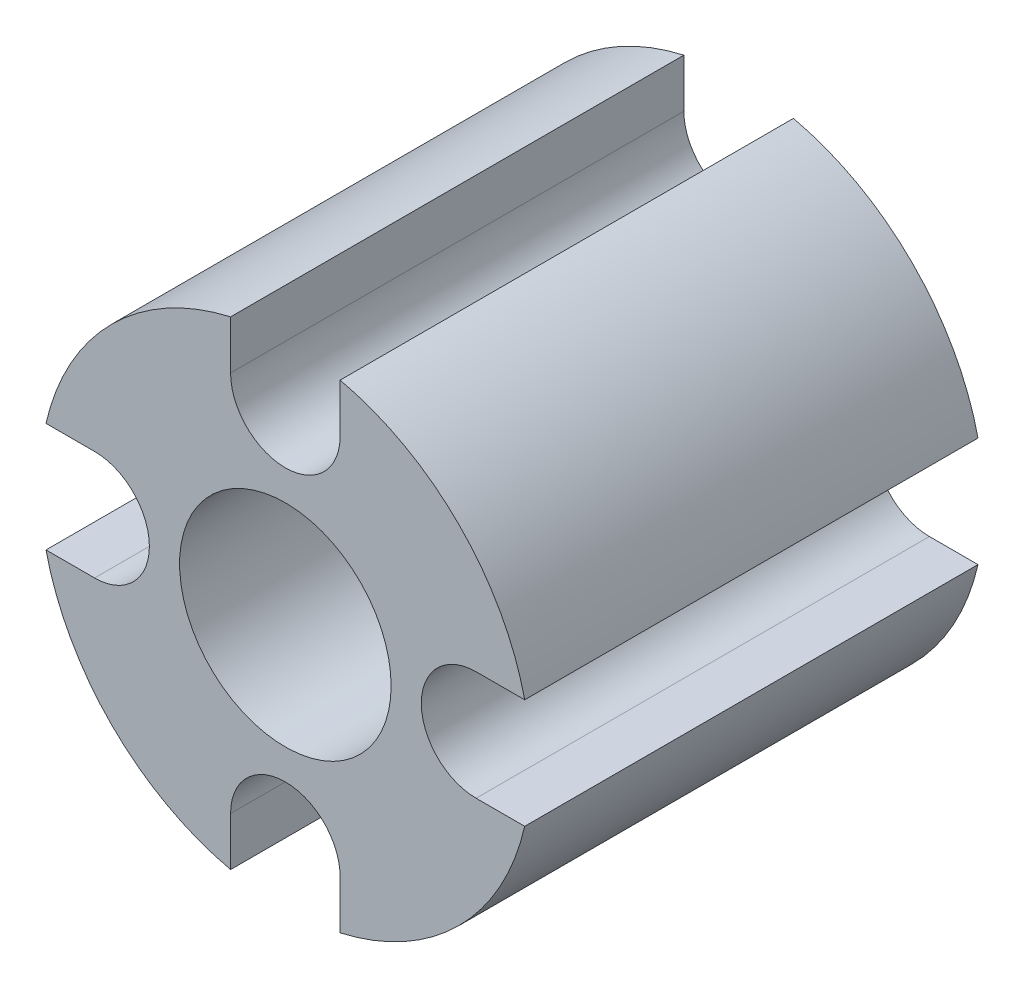
ISO-10303-21;
HEADER;
FILE_DESCRIPTION(('STEP AP214'),'2;1');
FILE_NAME('part.step','',(''),(''),'','','');
FILE_SCHEMA(('AUTOMOTIVE_DESIGN { 1 0 10303 214 1 1 1 1 }'));
ENDSEC;
DATA;
#1=APPLICATION_CONTEXT('core data for automotive mechanical design processes');
#2=APPLICATION_PROTOCOL_DEFINITION('international standard','automotive_design',2000,#1);
#3=PRODUCT_CONTEXT('',#1,'mechanical');
#4=PRODUCT('Part','Part','',(#3));
#5=PRODUCT_RELATED_PRODUCT_CATEGORY('part','',(#4));
#6=PRODUCT_DEFINITION_FORMATION('','',#4);
#7=PRODUCT_DEFINITION_CONTEXT('part definition',#1,'design');
#8=PRODUCT_DEFINITION('design','',#6,#7);
#9=PRODUCT_DEFINITION_SHAPE('','',#8);
#10=(LENGTH_UNIT() NAMED_UNIT(*) SI_UNIT(.MILLI.,.METRE.));
#11=(NAMED_UNIT(*) PLANE_ANGLE_UNIT() SI_UNIT($,.RADIAN.));
#12=(NAMED_UNIT(*) SI_UNIT($,.STERADIAN.) SOLID_ANGLE_UNIT());
#13=UNCERTAINTY_MEASURE_WITH_UNIT(LENGTH_MEASURE(1.E-05),#10,'distance_accuracy_value','');
#14=(GEOMETRIC_REPRESENTATION_CONTEXT(3) GLOBAL_UNCERTAINTY_ASSIGNED_CONTEXT((#13)) GLOBAL_UNIT_ASSIGNED_CONTEXT((#10,
#11,#12)) REPRESENTATION_CONTEXT('',''));
#15=CARTESIAN_POINT('',(0.,0.,0.));
#16=DIRECTION('',(0.,0.,1.));
#17=DIRECTION('',(1.,0.,0.));
#18=AXIS2_PLACEMENT_3D('',#15,#16,#17);
#19=CARTESIAN_POINT('',(0.,2.525,6.));
#20=DIRECTION('',(0.,0.,1.));
#21=DIRECTION('',(1.,0.,0.));
#22=AXIS2_PLACEMENT_3D('',#19,#20,#21);
#23=PLANE('',#22);
#24=CARTESIAN_POINT('',(0.,2.525,6.));
#25=DIRECTION('',(0.,0.,-1.));
#26=DIRECTION('',(1.,0.,0.));
#27=AXIS2_PLACEMENT_3D('',#24,#25,#26);
#28=CIRCLE('',#27,0.725);
#29=CARTESIAN_POINT('',(0.725,2.525,6.));
#30=VERTEX_POINT('',#29);
#31=CARTESIAN_POINT('',(-0.725,2.525,6.));
#32=VERTEX_POINT('',#31);
#33=EDGE_CURVE('E209',#30,#32,#28,.T.);
#34=ORIENTED_EDGE('',*,*,#33,.T.);
#35=DIRECTION('',(0.,1.,0.));
#36=VECTOR('',#35,1.);
#37=CARTESIAN_POINT('',(-0.725,2.525,6.));
#38=LINE('',#37,#36);
#39=CARTESIAN_POINT('',(-0.724999999999996,3.16810274454598,6.));
#40=VERTEX_POINT('',#39);
#41=EDGE_CURVE('E117',#32,#40,#38,.T.);
#42=ORIENTED_EDGE('',*,*,#41,.T.);
#43=CARTESIAN_POINT('',(0.,0.,6.));
#44=DIRECTION('',(0.,0.,1.));
#45=DIRECTION('',(1.,0.,0.));
#46=AXIS2_PLACEMENT_3D('',#43,#44,#45);
#47=CIRCLE('',#46,3.24999999999997);
#48=CARTESIAN_POINT('',(-3.16810274454595,0.724999999999984,6.));
#49=VERTEX_POINT('',#48);
#50=EDGE_CURVE('E248',#40,#49,#47,.T.);
#51=ORIENTED_EDGE('',*,*,#50,.T.);
#52=DIRECTION('',(1.,0.,0.));
#53=VECTOR('',#52,1.);
#54=CARTESIAN_POINT('',(-2.525,0.724999999999996,6.));
#55=LINE('',#54,#53);
#56=CARTESIAN_POINT('',(-2.525,0.725,6.));
#57=VERTEX_POINT('',#56);
#58=EDGE_CURVE('E267',#49,#57,#55,.T.);
#59=ORIENTED_EDGE('',*,*,#58,.T.);
#60=CARTESIAN_POINT('',(-2.525,0.,6.));
#61=DIRECTION('',(0.,0.,-1.));
#62=DIRECTION('',(1.,0.,0.));
#63=AXIS2_PLACEMENT_3D('',#60,#61,#62);
#64=CIRCLE('',#63,0.725);
#65=CARTESIAN_POINT('',(-2.525,-0.725000000000004,6.));
#66=VERTEX_POINT('',#65);
#67=EDGE_CURVE('E264',#57,#66,#64,.T.);
#68=ORIENTED_EDGE('',*,*,#67,.T.);
#69=DIRECTION('',(-1.,0.,0.));
#70=VECTOR('',#69,1.);
#71=CARTESIAN_POINT('',(-2.525,-0.725000000000004,6.));
#72=LINE('',#71,#70);
#73=CARTESIAN_POINT('',(-3.16810274454602,-0.724999999999966,6.));
#74=VERTEX_POINT('',#73);
#75=EDGE_CURVE('E266',#66,#74,#72,.T.);
#76=ORIENTED_EDGE('',*,*,#75,.T.);
#77=CARTESIAN_POINT('',(0.,0.,6.));
#78=DIRECTION('',(0.,0.,1.));
#79=DIRECTION('',(1.,0.,0.));
#80=AXIS2_PLACEMENT_3D('',#77,#78,#79);
#81=CIRCLE('',#80,3.25);
#82=CARTESIAN_POINT('',(-0.724999999999996,-3.16810274454602,6.));
#83=VERTEX_POINT('',#82);
#84=EDGE_CURVE('E269',#74,#83,#81,.T.);
#85=ORIENTED_EDGE('',*,*,#84,.T.);
#86=DIRECTION('',(0.,1.,0.));
#87=VECTOR('',#86,1.);
#88=CARTESIAN_POINT('',(-0.724999999999996,-2.525,6.));
#89=LINE('',#88,#87);
#90=CARTESIAN_POINT('',(-0.724999999999996,-2.525,6.));
#91=VERTEX_POINT('',#90);
#92=EDGE_CURVE('E275',#83,#91,#89,.T.);
#93=ORIENTED_EDGE('',*,*,#92,.T.);
#94=CARTESIAN_POINT('',(0.,-2.525,6.));
#95=DIRECTION('',(0.,0.,-1.));
#96=DIRECTION('',(1.,0.,0.));
#97=AXIS2_PLACEMENT_3D('',#94,#95,#96);
#98=CIRCLE('',#97,0.725);
#99=CARTESIAN_POINT('',(0.725000000000004,-2.525,6.));
#100=VERTEX_POINT('',#99);
#101=EDGE_CURVE('E277',#91,#100,#98,.T.);
#102=ORIENTED_EDGE('',*,*,#101,.T.);
#103=DIRECTION('',(0.,-1.,0.));
#104=VECTOR('',#103,1.);
#105=CARTESIAN_POINT('',(0.725000000000004,-2.525,6.));
#106=LINE('',#105,#104);
#107=CARTESIAN_POINT('',(0.725000000000004,-3.16810274454602,6.));
#108=VERTEX_POINT('',#107);
#109=EDGE_CURVE('E279',#100,#108,#106,.T.);
#110=ORIENTED_EDGE('',*,*,#109,.T.);
#111=CARTESIAN_POINT('',(0.,0.,6.));
#112=DIRECTION('',(0.,0.,1.));
#113=DIRECTION('',(1.,0.,0.));
#114=AXIS2_PLACEMENT_3D('',#111,#112,#113);
#115=CIRCLE('',#114,3.25);
#116=CARTESIAN_POINT('',(3.16810274454602,-0.724999999999996,6.));
#117=VERTEX_POINT('',#116);
#118=EDGE_CURVE('E281',#108,#117,#115,.T.);
#119=ORIENTED_EDGE('',*,*,#118,.T.);
#120=DIRECTION('',(-1.,0.,0.));
#121=VECTOR('',#120,1.);
#122=CARTESIAN_POINT('',(2.525,-0.724999999999996,6.));
#123=LINE('',#122,#121);
#124=CARTESIAN_POINT('',(2.525,-0.724999999999996,6.));
#125=VERTEX_POINT('',#124);
#126=EDGE_CURVE('E283',#117,#125,#123,.T.);
#127=ORIENTED_EDGE('',*,*,#126,.T.);
#128=CARTESIAN_POINT('',(2.525,0.,6.));
#129=DIRECTION('',(0.,0.,-1.));
#130=DIRECTION('',(1.,0.,0.));
#131=AXIS2_PLACEMENT_3D('',#128,#129,#130);
#132=CIRCLE('',#131,0.725);
#133=CARTESIAN_POINT('',(2.525,0.725000000000003,6.));
#134=VERTEX_POINT('',#133);
#135=EDGE_CURVE('E160',#125,#134,#132,.T.);
#136=ORIENTED_EDGE('',*,*,#135,.T.);
#137=DIRECTION('',(1.,0.,0.));
#138=VECTOR('',#137,1.);
#139=CARTESIAN_POINT('',(2.525,0.725000000000003,6.));
#140=LINE('',#139,#138);
#141=CARTESIAN_POINT('',(3.16810274454601,0.725000000000004,6.));
#142=VERTEX_POINT('',#141);
#143=EDGE_CURVE('E154',#134,#142,#140,.T.);
#144=ORIENTED_EDGE('',*,*,#143,.T.);
#145=CARTESIAN_POINT('',(0.,0.,6.));
#146=DIRECTION('',(0.,0.,1.));
#147=DIRECTION('',(1.,0.,0.));
#148=AXIS2_PLACEMENT_3D('',#145,#146,#147);
#149=CIRCLE('',#148,3.25);
#150=CARTESIAN_POINT('',(0.725,3.16810274454602,6.));
#151=VERTEX_POINT('',#150);
#152=EDGE_CURVE('E158',#142,#151,#149,.T.);
#153=ORIENTED_EDGE('',*,*,#152,.T.);
#154=DIRECTION('',(0.,-1.,0.));
#155=VECTOR('',#154,1.);
#156=CARTESIAN_POINT('',(0.725,2.525,6.));
#157=LINE('',#156,#155);
#158=EDGE_CURVE('E50',#151,#30,#157,.T.);
#159=ORIENTED_EDGE('',*,*,#158,.T.);
#160=EDGE_LOOP('',(#34,#42,#51,#59,#68,#76,#85,#93,#102,#110,#119,#127,#136,#144,#153,#159));
#161=FACE_BOUND('',#160,.T.);
#162=CARTESIAN_POINT('',(0.,0.,6.));
#163=DIRECTION('',(0.,0.,1.));
#164=DIRECTION('',(1.,0.,0.));
#165=AXIS2_PLACEMENT_3D('',#162,#163,#164);
#166=CIRCLE('',#165,1.4);
#167=CARTESIAN_POINT('',(1.4,0.,6.));
#168=VERTEX_POINT('',#167);
#169=EDGE_CURVE('E182',#168,#168,#166,.T.);
#170=ORIENTED_EDGE('',*,*,#169,.F.);
#171=EDGE_LOOP('',(#170));
#172=FACE_BOUND('',#171,.T.);
#173=ADVANCED_FACE('F33',(#161,#172),#23,.T.);
#174=CARTESIAN_POINT('',(0.,2.525,0.));
#175=DIRECTION('',(0.,0.,1.));
#176=DIRECTION('',(1.,0.,0.));
#177=AXIS2_PLACEMENT_3D('',#174,#175,#176);
#178=PLANE('',#177);
#179=CARTESIAN_POINT('',(0.,2.525,0.));
#180=DIRECTION('',(0.,0.,-1.));
#181=DIRECTION('',(1.,0.,0.));
#182=AXIS2_PLACEMENT_3D('',#179,#180,#181);
#183=CIRCLE('',#182,0.725);
#184=CARTESIAN_POINT('',(0.725,2.525,0.));
#185=VERTEX_POINT('',#184);
#186=CARTESIAN_POINT('',(-0.725,2.525,0.));
#187=VERTEX_POINT('',#186);
#188=EDGE_CURVE('E178',#185,#187,#183,.T.);
#189=ORIENTED_EDGE('',*,*,#188,.F.);
#190=DIRECTION('',(0.,-1.,0.));
#191=VECTOR('',#190,1.);
#192=CARTESIAN_POINT('',(0.725,2.525,0.));
#193=LINE('',#192,#191);
#194=CARTESIAN_POINT('',(0.725,3.16810274454602,0.));
#195=VERTEX_POINT('',#194);
#196=EDGE_CURVE('E109',#195,#185,#193,.T.);
#197=ORIENTED_EDGE('',*,*,#196,.F.);
#198=CARTESIAN_POINT('',(0.,0.,0.));
#199=DIRECTION('',(0.,0.,1.));
#200=DIRECTION('',(1.,0.,0.));
#201=AXIS2_PLACEMENT_3D('',#198,#199,#200);
#202=CIRCLE('',#201,3.25);
#203=CARTESIAN_POINT('',(3.16810274454601,0.725000000000004,0.));
#204=VERTEX_POINT('',#203);
#205=EDGE_CURVE('E103',#204,#195,#202,.T.);
#206=ORIENTED_EDGE('',*,*,#205,.F.);
#207=DIRECTION('',(1.,0.,0.));
#208=VECTOR('',#207,1.);
#209=CARTESIAN_POINT('',(2.525,0.725000000000003,0.));
#210=LINE('',#209,#208);
#211=CARTESIAN_POINT('',(2.525,0.725000000000003,0.));
#212=VERTEX_POINT('',#211);
#213=EDGE_CURVE('E168',#212,#204,#210,.T.);
#214=ORIENTED_EDGE('',*,*,#213,.F.);
#215=CARTESIAN_POINT('',(2.525,0.,0.));
#216=DIRECTION('',(0.,0.,-1.));
#217=DIRECTION('',(1.,0.,0.));
#218=AXIS2_PLACEMENT_3D('',#215,#216,#217);
#219=CIRCLE('',#218,0.725);
#220=CARTESIAN_POINT('',(2.525,-0.724999999999996,0.));
#221=VERTEX_POINT('',#220);
#222=EDGE_CURVE('E204',#221,#212,#219,.T.);
#223=ORIENTED_EDGE('',*,*,#222,.F.);
#224=DIRECTION('',(-1.,0.,0.));
#225=VECTOR('',#224,1.);
#226=CARTESIAN_POINT('',(2.525,-0.724999999999996,0.));
#227=LINE('',#226,#225);
#228=CARTESIAN_POINT('',(3.16810274454602,-0.724999999999996,0.));
#229=VERTEX_POINT('',#228);
#230=EDGE_CURVE('E202',#229,#221,#227,.T.);
#231=ORIENTED_EDGE('',*,*,#230,.F.);
#232=CARTESIAN_POINT('',(0.,0.,0.));
#233=DIRECTION('',(0.,0.,1.));
#234=DIRECTION('',(1.,0.,0.));
#235=AXIS2_PLACEMENT_3D('',#232,#233,#234);
#236=CIRCLE('',#235,3.25);
#237=CARTESIAN_POINT('',(0.725000000000004,-3.16810274454602,0.));
#238=VERTEX_POINT('',#237);
#239=EDGE_CURVE('E200',#238,#229,#236,.T.);
#240=ORIENTED_EDGE('',*,*,#239,.F.);
#241=DIRECTION('',(0.,-1.,0.));
#242=VECTOR('',#241,1.);
#243=CARTESIAN_POINT('',(0.725000000000004,-2.525,0.));
#244=LINE('',#243,#242);
#245=CARTESIAN_POINT('',(0.725000000000004,-2.525,0.));
#246=VERTEX_POINT('',#245);
#247=EDGE_CURVE('E198',#246,#238,#244,.T.);
#248=ORIENTED_EDGE('',*,*,#247,.F.);
#249=CARTESIAN_POINT('',(0.,-2.525,0.));
#250=DIRECTION('',(0.,0.,-1.));
#251=DIRECTION('',(1.,0.,0.));
#252=AXIS2_PLACEMENT_3D('',#249,#250,#251);
#253=CIRCLE('',#252,0.725);
#254=CARTESIAN_POINT('',(-0.724999999999996,-2.525,0.));
#255=VERTEX_POINT('',#254);
#256=EDGE_CURVE('E196',#255,#246,#253,.T.);
#257=ORIENTED_EDGE('',*,*,#256,.F.);
#258=DIRECTION('',(0.,1.,0.));
#259=VECTOR('',#258,1.);
#260=CARTESIAN_POINT('',(-0.724999999999996,-2.525,0.));
#261=LINE('',#260,#259);
#262=CARTESIAN_POINT('',(-0.724999999999996,-3.16810274454602,0.));
#263=VERTEX_POINT('',#262);
#264=EDGE_CURVE('E194',#263,#255,#261,.T.);
#265=ORIENTED_EDGE('',*,*,#264,.F.);
#266=CARTESIAN_POINT('',(0.,0.,0.));
#267=DIRECTION('',(0.,0.,1.));
#268=DIRECTION('',(1.,0.,0.));
#269=AXIS2_PLACEMENT_3D('',#266,#267,#268);
#270=CIRCLE('',#269,3.25);
#271=CARTESIAN_POINT('',(-3.16810274454602,-0.724999999999966,0.));
#272=VERTEX_POINT('',#271);
#273=EDGE_CURVE('E192',#272,#263,#270,.T.);
#274=ORIENTED_EDGE('',*,*,#273,.F.);
#275=DIRECTION('',(-1.,0.,0.));
#276=VECTOR('',#275,1.);
#277=CARTESIAN_POINT('',(-2.525,-0.725000000000004,0.));
#278=LINE('',#277,#276);
#279=CARTESIAN_POINT('',(-2.525,-0.725000000000004,0.));
#280=VERTEX_POINT('',#279);
#281=EDGE_CURVE('E190',#280,#272,#278,.T.);
#282=ORIENTED_EDGE('',*,*,#281,.F.);
#283=CARTESIAN_POINT('',(-2.525,0.,0.));
#284=DIRECTION('',(0.,0.,-1.));
#285=DIRECTION('',(1.,0.,0.));
#286=AXIS2_PLACEMENT_3D('',#283,#284,#285);
#287=CIRCLE('',#286,0.725);
#288=CARTESIAN_POINT('',(-2.525,0.725,0.));
#289=VERTEX_POINT('',#288);
#290=EDGE_CURVE('E188',#289,#280,#287,.T.);
#291=ORIENTED_EDGE('',*,*,#290,.F.);
#292=DIRECTION('',(1.,0.,0.));
#293=VECTOR('',#292,1.);
#294=CARTESIAN_POINT('',(-2.525,0.724999999999996,0.));
#295=LINE('',#294,#293);
#296=CARTESIAN_POINT('',(-3.16810274454595,0.724999999999984,0.));
#297=VERTEX_POINT('',#296);
#298=EDGE_CURVE('E186',#297,#289,#295,.T.);
#299=ORIENTED_EDGE('',*,*,#298,.F.);
#300=CARTESIAN_POINT('',(0.,0.,0.));
#301=DIRECTION('',(0.,0.,1.));
#302=DIRECTION('',(1.,0.,0.));
#303=AXIS2_PLACEMENT_3D('',#300,#301,#302);
#304=CIRCLE('',#303,3.24999999999997);
#305=CARTESIAN_POINT('',(-0.724999999999996,3.16810274454598,0.));
#306=VERTEX_POINT('',#305);
#307=EDGE_CURVE('E184',#306,#297,#304,.T.);
#308=ORIENTED_EDGE('',*,*,#307,.F.);
#309=DIRECTION('',(0.,1.,0.));
#310=VECTOR('',#309,1.);
#311=CARTESIAN_POINT('',(-0.725,2.525,0.));
#312=LINE('',#311,#310);
#313=EDGE_CURVE('E181',#187,#306,#312,.T.);
#314=ORIENTED_EDGE('',*,*,#313,.F.);
#315=EDGE_LOOP('',(#189,#197,#206,#214,#223,#231,#240,#248,#257,#265,#274,#282,#291,#299,#308,#314));
#316=FACE_BOUND('',#315,.T.);
#317=CARTESIAN_POINT('',(0.,0.,0.));
#318=DIRECTION('',(0.,0.,1.));
#319=DIRECTION('',(1.,0.,0.));
#320=AXIS2_PLACEMENT_3D('',#317,#318,#319);
#321=CIRCLE('',#320,1.4);
#322=CARTESIAN_POINT('',(1.4,0.,0.));
#323=VERTEX_POINT('',#322);
#324=EDGE_CURVE('E488',#323,#323,#321,.T.);
#325=ORIENTED_EDGE('',*,*,#324,.T.);
#326=EDGE_LOOP('',(#325));
#327=FACE_BOUND('',#326,.T.);
#328=ADVANCED_FACE('F252',(#316,#327),#178,.F.);
#329=CARTESIAN_POINT('',(0.,2.525,6.));
#330=DIRECTION('',(0.,0.,-1.));
#331=DIRECTION('',(-1.,0.,0.));
#332=AXIS2_PLACEMENT_3D('',#329,#330,#331);
#333=CYLINDRICAL_SURFACE('',#332,0.725);
#334=ORIENTED_EDGE('',*,*,#188,.T.);
#335=DIRECTION('',(0.,0.,-1.));
#336=VECTOR('',#335,1.);
#337=CARTESIAN_POINT('',(-0.725,2.525,6.));
#338=LINE('',#337,#336);
#339=EDGE_CURVE('E11',#32,#187,#338,.T.);
#340=ORIENTED_EDGE('',*,*,#339,.F.);
#341=ORIENTED_EDGE('',*,*,#33,.F.);
#342=DIRECTION('',(0.,0.,-1.));
#343=VECTOR('',#342,1.);
#344=CARTESIAN_POINT('',(0.725,2.525,6.));
#345=LINE('',#344,#343);
#346=EDGE_CURVE('E174',#30,#185,#345,.T.);
#347=ORIENTED_EDGE('',*,*,#346,.T.);
#348=EDGE_LOOP('',(#334,#340,#341,#347));
#349=FACE_BOUND('',#348,.T.);
#350=ADVANCED_FACE('F35',(#349),#333,.F.);
#351=CARTESIAN_POINT('',(-0.725,2.525,6.));
#352=DIRECTION('',(-1.,0.,0.));
#353=DIRECTION('',(0.,-1.,0.));
#354=AXIS2_PLACEMENT_3D('',#351,#352,#353);
#355=PLANE('',#354);
#356=ORIENTED_EDGE('',*,*,#313,.T.);
#357=DIRECTION('',(0.,0.,-1.));
#358=VECTOR('',#357,1.);
#359=CARTESIAN_POINT('',(-0.724999999999996,3.16810274454598,6.));
#360=LINE('',#359,#358);
#361=EDGE_CURVE('E42',#40,#306,#360,.T.);
#362=ORIENTED_EDGE('',*,*,#361,.F.);
#363=ORIENTED_EDGE('',*,*,#41,.F.);
#364=ORIENTED_EDGE('',*,*,#339,.T.);
#365=EDGE_LOOP('',(#356,#362,#363,#364));
#366=FACE_BOUND('',#365,.T.);
#367=ADVANCED_FACE('F317',(#366),#355,.F.);
#368=CARTESIAN_POINT('',(0.,0.,6.));
#369=DIRECTION('',(0.,0.,-1.));
#370=DIRECTION('',(-1.,0.,0.));
#371=AXIS2_PLACEMENT_3D('',#368,#369,#370);
#372=CYLINDRICAL_SURFACE('',#371,3.24999999999997);
#373=ORIENTED_EDGE('',*,*,#307,.T.);
#374=DIRECTION('',(0.,0.,-1.));
#375=VECTOR('',#374,1.);
#376=CARTESIAN_POINT('',(-3.16810274454595,0.724999999999984,6.));
#377=LINE('',#376,#375);
#378=EDGE_CURVE('E240',#49,#297,#377,.T.);
#379=ORIENTED_EDGE('',*,*,#378,.F.);
#380=ORIENTED_EDGE('',*,*,#50,.F.);
#381=ORIENTED_EDGE('',*,*,#361,.T.);
#382=EDGE_LOOP('',(#373,#379,#380,#381));
#383=FACE_BOUND('',#382,.T.);
#384=ADVANCED_FACE('F246',(#383),#372,.T.);
#385=CARTESIAN_POINT('',(-2.525,0.724999999999996,6.));
#386=DIRECTION('',(0.,1.,0.));
#387=DIRECTION('',(-1.,0.,0.));
#388=AXIS2_PLACEMENT_3D('',#385,#386,#387);
#389=PLANE('',#388);
#390=ORIENTED_EDGE('',*,*,#298,.T.);
#391=DIRECTION('',(0.,0.,-1.));
#392=VECTOR('',#391,1.);
#393=CARTESIAN_POINT('',(-2.525,0.725,6.));
#394=LINE('',#393,#392);
#395=EDGE_CURVE('E237',#57,#289,#394,.T.);
#396=ORIENTED_EDGE('',*,*,#395,.F.);
#397=ORIENTED_EDGE('',*,*,#58,.F.);
#398=ORIENTED_EDGE('',*,*,#378,.T.);
#399=EDGE_LOOP('',(#390,#396,#397,#398));
#400=FACE_BOUND('',#399,.T.);
#401=ADVANCED_FACE('F258',(#400),#389,.F.);
#402=CARTESIAN_POINT('',(-2.525,0.,6.));
#403=DIRECTION('',(0.,0.,-1.));
#404=DIRECTION('',(-1.,0.,0.));
#405=AXIS2_PLACEMENT_3D('',#402,#403,#404);
#406=CYLINDRICAL_SURFACE('',#405,0.725);
#407=ORIENTED_EDGE('',*,*,#290,.T.);
#408=DIRECTION('',(0.,0.,-1.));
#409=VECTOR('',#408,1.);
#410=CARTESIAN_POINT('',(-2.525,-0.725000000000004,6.));
#411=LINE('',#410,#409);
#412=EDGE_CURVE('E234',#66,#280,#411,.T.);
#413=ORIENTED_EDGE('',*,*,#412,.F.);
#414=ORIENTED_EDGE('',*,*,#67,.F.);
#415=ORIENTED_EDGE('',*,*,#395,.T.);
#416=EDGE_LOOP('',(#407,#413,#414,#415));
#417=FACE_BOUND('',#416,.T.);
#418=ADVANCED_FACE('F262',(#417),#406,.F.);
#419=CARTESIAN_POINT('',(-2.525,-0.725000000000004,6.));
#420=DIRECTION('',(0.,-1.,0.));
#421=DIRECTION('',(1.,0.,0.));
#422=AXIS2_PLACEMENT_3D('',#419,#420,#421);
#423=PLANE('',#422);
#424=ORIENTED_EDGE('',*,*,#281,.T.);
#425=DIRECTION('',(0.,0.,-1.));
#426=VECTOR('',#425,1.);
#427=CARTESIAN_POINT('',(-3.16810274454602,-0.724999999999966,6.));
#428=LINE('',#427,#426);
#429=EDGE_CURVE('E231',#74,#272,#428,.T.);
#430=ORIENTED_EDGE('',*,*,#429,.F.);
#431=ORIENTED_EDGE('',*,*,#75,.F.);
#432=ORIENTED_EDGE('',*,*,#412,.T.);
#433=EDGE_LOOP('',(#424,#430,#431,#432));
#434=FACE_BOUND('',#433,.T.);
#435=ADVANCED_FACE('F330',(#434),#423,.F.);
#436=CARTESIAN_POINT('',(0.,0.,6.));
#437=DIRECTION('',(0.,0.,-1.));
#438=DIRECTION('',(-1.,0.,0.));
#439=AXIS2_PLACEMENT_3D('',#436,#437,#438);
#440=CYLINDRICAL_SURFACE('',#439,3.25);
#441=ORIENTED_EDGE('',*,*,#273,.T.);
#442=DIRECTION('',(0.,0.,-1.));
#443=VECTOR('',#442,1.);
#444=CARTESIAN_POINT('',(-0.724999999999996,-3.16810274454602,6.));
#445=LINE('',#444,#443);
#446=EDGE_CURVE('E228',#83,#263,#445,.T.);
#447=ORIENTED_EDGE('',*,*,#446,.F.);
#448=ORIENTED_EDGE('',*,*,#84,.F.);
#449=ORIENTED_EDGE('',*,*,#429,.T.);
#450=EDGE_LOOP('',(#441,#447,#448,#449));
#451=FACE_BOUND('',#450,.T.);
#452=ADVANCED_FACE('F333',(#451),#440,.T.);
#453=CARTESIAN_POINT('',(-0.724999999999996,-2.525,6.));
#454=DIRECTION('',(-1.,0.,0.));
#455=DIRECTION('',(0.,-1.,0.));
#456=AXIS2_PLACEMENT_3D('',#453,#454,#455);
#457=PLANE('',#456);
#458=ORIENTED_EDGE('',*,*,#264,.T.);
#459=DIRECTION('',(0.,0.,-1.));
#460=VECTOR('',#459,1.);
#461=CARTESIAN_POINT('',(-0.724999999999996,-2.525,6.));
#462=LINE('',#461,#460);
#463=EDGE_CURVE('E225',#91,#255,#462,.T.);
#464=ORIENTED_EDGE('',*,*,#463,.F.);
#465=ORIENTED_EDGE('',*,*,#92,.F.);
#466=ORIENTED_EDGE('',*,*,#446,.T.);
#467=EDGE_LOOP('',(#458,#464,#465,#466));
#468=FACE_BOUND('',#467,.T.);
#469=ADVANCED_FACE('F337',(#468),#457,.F.);
#470=CARTESIAN_POINT('',(0.,-2.525,6.));
#471=DIRECTION('',(0.,0.,-1.));
#472=DIRECTION('',(-1.,0.,0.));
#473=AXIS2_PLACEMENT_3D('',#470,#471,#472);
#474=CYLINDRICAL_SURFACE('',#473,0.725);
#475=ORIENTED_EDGE('',*,*,#256,.T.);
#476=DIRECTION('',(0.,0.,-1.));
#477=VECTOR('',#476,1.);
#478=CARTESIAN_POINT('',(0.725000000000004,-2.525,6.));
#479=LINE('',#478,#477);
#480=EDGE_CURVE('E222',#100,#246,#479,.T.);
#481=ORIENTED_EDGE('',*,*,#480,.F.);
#482=ORIENTED_EDGE('',*,*,#101,.F.);
#483=ORIENTED_EDGE('',*,*,#463,.T.);
#484=EDGE_LOOP('',(#475,#481,#482,#483));
#485=FACE_BOUND('',#484,.T.);
#486=ADVANCED_FACE('F341',(#485),#474,.F.);
#487=CARTESIAN_POINT('',(0.725000000000004,-2.525,6.));
#488=DIRECTION('',(1.,0.,0.));
#489=DIRECTION('',(0.,1.,0.));
#490=AXIS2_PLACEMENT_3D('',#487,#488,#489);
#491=PLANE('',#490);
#492=ORIENTED_EDGE('',*,*,#247,.T.);
#493=DIRECTION('',(0.,0.,-1.));
#494=VECTOR('',#493,1.);
#495=CARTESIAN_POINT('',(0.725000000000004,-3.16810274454602,6.));
#496=LINE('',#495,#494);
#497=EDGE_CURVE('E219',#108,#238,#496,.T.);
#498=ORIENTED_EDGE('',*,*,#497,.F.);
#499=ORIENTED_EDGE('',*,*,#109,.F.);
#500=ORIENTED_EDGE('',*,*,#480,.T.);
#501=EDGE_LOOP('',(#492,#498,#499,#500));
#502=FACE_BOUND('',#501,.T.);
#503=ADVANCED_FACE('F345',(#502),#491,.F.);
#504=CARTESIAN_POINT('',(0.,0.,6.));
#505=DIRECTION('',(0.,0.,-1.));
#506=DIRECTION('',(-1.,0.,0.));
#507=AXIS2_PLACEMENT_3D('',#504,#505,#506);
#508=CYLINDRICAL_SURFACE('',#507,3.25);
#509=ORIENTED_EDGE('',*,*,#239,.T.);
#510=DIRECTION('',(0.,0.,-1.));
#511=VECTOR('',#510,1.);
#512=CARTESIAN_POINT('',(3.16810274454602,-0.724999999999996,6.));
#513=LINE('',#512,#511);
#514=EDGE_CURVE('E216',#117,#229,#513,.T.);
#515=ORIENTED_EDGE('',*,*,#514,.F.);
#516=ORIENTED_EDGE('',*,*,#118,.F.);
#517=ORIENTED_EDGE('',*,*,#497,.T.);
#518=EDGE_LOOP('',(#509,#515,#516,#517));
#519=FACE_BOUND('',#518,.T.);
#520=ADVANCED_FACE('F349',(#519),#508,.T.);
#521=CARTESIAN_POINT('',(2.525,-0.724999999999996,6.));
#522=DIRECTION('',(0.,-1.,0.));
#523=DIRECTION('',(1.,0.,0.));
#524=AXIS2_PLACEMENT_3D('',#521,#522,#523);
#525=PLANE('',#524);
#526=ORIENTED_EDGE('',*,*,#230,.T.);
#527=DIRECTION('',(0.,0.,-1.));
#528=VECTOR('',#527,1.);
#529=CARTESIAN_POINT('',(2.525,-0.724999999999996,6.));
#530=LINE('',#529,#528);
#531=EDGE_CURVE('E213',#125,#221,#530,.T.);
#532=ORIENTED_EDGE('',*,*,#531,.F.);
#533=ORIENTED_EDGE('',*,*,#126,.F.);
#534=ORIENTED_EDGE('',*,*,#514,.T.);
#535=EDGE_LOOP('',(#526,#532,#533,#534));
#536=FACE_BOUND('',#535,.T.);
#537=ADVANCED_FACE('F289',(#536),#525,.F.);
#538=CARTESIAN_POINT('',(2.525,0.,6.));
#539=DIRECTION('',(0.,0.,-1.));
#540=DIRECTION('',(-1.,0.,0.));
#541=AXIS2_PLACEMENT_3D('',#538,#539,#540);
#542=CYLINDRICAL_SURFACE('',#541,0.725);
#543=ORIENTED_EDGE('',*,*,#222,.T.);
#544=DIRECTION('',(0.,0.,-1.));
#545=VECTOR('',#544,1.);
#546=CARTESIAN_POINT('',(2.525,0.725000000000003,6.));
#547=LINE('',#546,#545);
#548=EDGE_CURVE('E169',#134,#212,#547,.T.);
#549=ORIENTED_EDGE('',*,*,#548,.F.);
#550=ORIENTED_EDGE('',*,*,#135,.F.);
#551=ORIENTED_EDGE('',*,*,#531,.T.);
#552=EDGE_LOOP('',(#543,#549,#550,#551));
#553=FACE_BOUND('',#552,.T.);
#554=ADVANCED_FACE('F293',(#553),#542,.F.);
#555=CARTESIAN_POINT('',(2.525,0.725000000000003,6.));
#556=DIRECTION('',(0.,1.,0.));
#557=DIRECTION('',(-1.,0.,0.));
#558=AXIS2_PLACEMENT_3D('',#555,#556,#557);
#559=PLANE('',#558);
#560=ORIENTED_EDGE('',*,*,#213,.T.);
#561=DIRECTION('',(0.,0.,-1.));
#562=VECTOR('',#561,1.);
#563=CARTESIAN_POINT('',(3.16810274454601,0.725000000000004,6.));
#564=LINE('',#563,#562);
#565=EDGE_CURVE('E165',#142,#204,#564,.T.);
#566=ORIENTED_EDGE('',*,*,#565,.F.);
#567=ORIENTED_EDGE('',*,*,#143,.F.);
#568=ORIENTED_EDGE('',*,*,#548,.T.);
#569=EDGE_LOOP('',(#560,#566,#567,#568));
#570=FACE_BOUND('',#569,.T.);
#571=ADVANCED_FACE('F166',(#570),#559,.F.);
#572=CARTESIAN_POINT('',(0.,0.,6.));
#573=DIRECTION('',(0.,0.,-1.));
#574=DIRECTION('',(-1.,0.,0.));
#575=AXIS2_PLACEMENT_3D('',#572,#573,#574);
#576=CYLINDRICAL_SURFACE('',#575,3.25);
#577=ORIENTED_EDGE('',*,*,#205,.T.);
#578=DIRECTION('',(0.,0.,-1.));
#579=VECTOR('',#578,1.);
#580=CARTESIAN_POINT('',(0.725,3.16810274454602,6.));
#581=LINE('',#580,#579);
#582=EDGE_CURVE('E170',#151,#195,#581,.T.);
#583=ORIENTED_EDGE('',*,*,#582,.F.);
#584=ORIENTED_EDGE('',*,*,#152,.F.);
#585=ORIENTED_EDGE('',*,*,#565,.T.);
#586=EDGE_LOOP('',(#577,#583,#584,#585));
#587=FACE_BOUND('',#586,.T.);
#588=ADVANCED_FACE('F172',(#587),#576,.T.);
#589=CARTESIAN_POINT('',(0.725,2.525,6.));
#590=DIRECTION('',(1.,0.,0.));
#591=DIRECTION('',(0.,1.,0.));
#592=AXIS2_PLACEMENT_3D('',#589,#590,#591);
#593=PLANE('',#592);
#594=ORIENTED_EDGE('',*,*,#196,.T.);
#595=ORIENTED_EDGE('',*,*,#346,.F.);
#596=ORIENTED_EDGE('',*,*,#158,.F.);
#597=ORIENTED_EDGE('',*,*,#582,.T.);
#598=EDGE_LOOP('',(#594,#595,#596,#597));
#599=FACE_BOUND('',#598,.T.);
#600=ADVANCED_FACE('F297',(#599),#593,.F.);
#601=CARTESIAN_POINT('',(0.,0.,6.));
#602=DIRECTION('',(0.,0.,-1.));
#603=DIRECTION('',(-1.,0.,0.));
#604=AXIS2_PLACEMENT_3D('',#601,#602,#603);
#605=CYLINDRICAL_SURFACE('',#604,1.4);
#606=ORIENTED_EDGE('',*,*,#169,.T.);
#607=EDGE_LOOP('',(#606));
#608=FACE_BOUND('',#607,.T.);
#609=ORIENTED_EDGE('',*,*,#324,.F.);
#610=EDGE_LOOP('',(#609));
#611=FACE_BOUND('',#610,.T.);
#612=ADVANCED_FACE('F299',(#608,#611),#605,.F.);
#613=CLOSED_SHELL('',(#173,#328,#350,#367,#384,#401,#418,#435,#452,#469,#486,#503,#520,#537,
#554,#571,#588,#600,#612));
#614=MANIFOLD_SOLID_BREP('B2',#613);
#615=ADVANCED_BREP_SHAPE_REPRESENTATION('',(#18,#614),#14);
#616=SHAPE_DEFINITION_REPRESENTATION(#9,#615);
ENDSEC;
END-ISO-10303-21;
